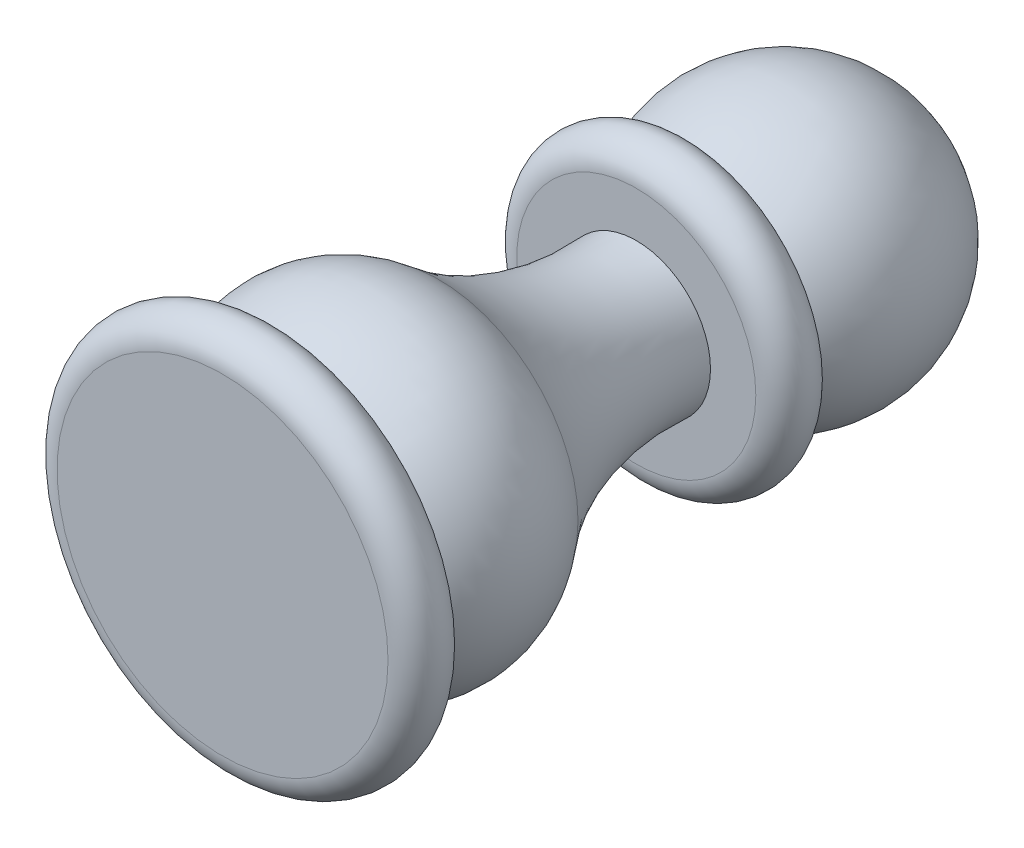
ISO-10303-21;
HEADER;
FILE_DESCRIPTION(('STEP AP214'),'2;1');
FILE_NAME('part.step','',(''),(''),'','','');
FILE_SCHEMA(('AUTOMOTIVE_DESIGN { 1 0 10303 214 1 1 1 1 }'));
ENDSEC;
DATA;
#1=APPLICATION_CONTEXT('core data for automotive mechanical design processes');
#2=APPLICATION_PROTOCOL_DEFINITION('international standard','automotive_design',2000,#1);
#3=PRODUCT_CONTEXT('',#1,'mechanical');
#4=PRODUCT('Part','Part','',(#3));
#5=PRODUCT_RELATED_PRODUCT_CATEGORY('part','',(#4));
#6=PRODUCT_DEFINITION_FORMATION('','',#4);
#7=PRODUCT_DEFINITION_CONTEXT('part definition',#1,'design');
#8=PRODUCT_DEFINITION('design','',#6,#7);
#9=PRODUCT_DEFINITION_SHAPE('','',#8);
#10=(LENGTH_UNIT() NAMED_UNIT(*) SI_UNIT(.MILLI.,.METRE.));
#11=(NAMED_UNIT(*) PLANE_ANGLE_UNIT() SI_UNIT($,.RADIAN.));
#12=(NAMED_UNIT(*) SI_UNIT($,.STERADIAN.) SOLID_ANGLE_UNIT());
#13=UNCERTAINTY_MEASURE_WITH_UNIT(LENGTH_MEASURE(1.E-05),#10,'distance_accuracy_value','');
#14=(GEOMETRIC_REPRESENTATION_CONTEXT(3) GLOBAL_UNCERTAINTY_ASSIGNED_CONTEXT((#13)) GLOBAL_UNIT_ASSIGNED_CONTEXT((#10,
#11,#12)) REPRESENTATION_CONTEXT('',''));
#15=CARTESIAN_POINT('',(0.,0.,0.));
#16=DIRECTION('',(0.,0.,1.));
#17=DIRECTION('',(1.,0.,0.));
#18=AXIS2_PLACEMENT_3D('',#15,#16,#17);
#19=CARTESIAN_POINT('',(0.,0.,0.));
#20=DIRECTION('',(0.,0.,1.));
#21=DIRECTION('',(1.,0.,0.));
#22=AXIS2_PLACEMENT_3D('',#19,#20,#21);
#23=PLANE('',#22);
#24=CARTESIAN_POINT('',(0.,0.,0.));
#25=DIRECTION('',(0.,0.,1.));
#26=DIRECTION('',(1.,0.,0.));
#27=AXIS2_PLACEMENT_3D('',#24,#25,#26);
#28=CIRCLE('',#27,9.);
#29=CARTESIAN_POINT('',(9.,0.,0.));
#30=VERTEX_POINT('',#29);
#31=EDGE_CURVE('E10',#30,#30,#28,.T.);
#32=ORIENTED_EDGE('',*,*,#31,.T.);
#33=EDGE_LOOP('',(#32));
#34=FACE_BOUND('',#33,.T.);
#35=ADVANCED_FACE('F41',(#34),#23,.T.);
#36=CARTESIAN_POINT('',(0.,0.,-1.5));
#37=DIRECTION('',(0.,0.,1.));
#38=DIRECTION('',(1.,0.,0.));
#39=AXIS2_PLACEMENT_3D('',#36,#37,#38);
#40=TOROIDAL_SURFACE('',#39,9.,1.5);
#41=CARTESIAN_POINT('',(0.,0.,-3.));
#42=DIRECTION('',(0.,0.,1.));
#43=DIRECTION('',(1.,0.,0.));
#44=AXIS2_PLACEMENT_3D('',#41,#42,#43);
#45=CIRCLE('',#44,9.);
#46=CARTESIAN_POINT('',(9.,0.,-3.));
#47=VERTEX_POINT('',#46);
#48=EDGE_CURVE('E47',#47,#47,#45,.T.);
#49=ORIENTED_EDGE('',*,*,#48,.T.);
#50=EDGE_LOOP('',(#49));
#51=FACE_BOUND('',#50,.T.);
#52=ORIENTED_EDGE('',*,*,#31,.F.);
#53=EDGE_LOOP('',(#52));
#54=FACE_BOUND('',#53,.T.);
#55=ADVANCED_FACE('F85',(#51,#54),#40,.T.);
#56=CARTESIAN_POINT('',(0.,0.,-3.));
#57=DIRECTION('',(0.,0.,-1.));
#58=DIRECTION('',(-1.,0.,0.));
#59=AXIS2_PLACEMENT_3D('',#56,#57,#58);
#60=PLANE('',#59);
#61=CARTESIAN_POINT('',(0.,0.,-3.));
#62=DIRECTION('',(0.,0.,1.));
#63=DIRECTION('',(1.,0.,0.));
#64=AXIS2_PLACEMENT_3D('',#61,#62,#63);
#65=CIRCLE('',#64,6.5);
#66=CARTESIAN_POINT('',(6.5,0.,-3.));
#67=VERTEX_POINT('',#66);
#68=EDGE_CURVE('E51',#67,#67,#65,.T.);
#69=ORIENTED_EDGE('',*,*,#68,.T.);
#70=EDGE_LOOP('',(#69));
#71=FACE_BOUND('',#70,.T.);
#72=ORIENTED_EDGE('',*,*,#48,.F.);
#73=EDGE_LOOP('',(#72));
#74=FACE_BOUND('',#73,.T.);
#75=ADVANCED_FACE('F89',(#71,#74),#60,.T.);
#76=CARTESIAN_POINT('',(0.,0.,-7.87339717240448));
#77=DIRECTION('',(0.,0.,1.));
#78=DIRECTION('',(1.,0.,0.));
#79=AXIS2_PLACEMENT_3D('',#76,#77,#78);
#80=DEGENERATE_TOROIDAL_SURFACE('',#79,3.,6.,.T.);
#81=CARTESIAN_POINT('',(0.,0.,-11.7595316034718));
#82=DIRECTION('',(0.,0.,1.));
#83=DIRECTION('',(1.,0.,0.));
#84=AXIS2_PLACEMENT_3D('',#81,#82,#83);
#85=CIRCLE('',#84,7.57142857142857);
#86=CARTESIAN_POINT('',(7.57142857142857,0.,-11.7595316034718));
#87=VERTEX_POINT('',#86);
#88=EDGE_CURVE('E55',#87,#87,#85,.T.);
#89=ORIENTED_EDGE('',*,*,#88,.T.);
#90=EDGE_LOOP('',(#89));
#91=FACE_BOUND('',#90,.T.);
#92=ORIENTED_EDGE('',*,*,#68,.F.);
#93=EDGE_LOOP('',(#92));
#94=FACE_BOUND('',#93,.T.);
#95=ADVANCED_FACE('F93',(#91,#94),#80,.T.);
#96=CARTESIAN_POINT('',(0.,0.,-21.4748676811399));
#97=DIRECTION('',(0.,0.,1.));
#98=DIRECTION('',(1.,0.,0.));
#99=AXIS2_PLACEMENT_3D('',#96,#97,#98);
#100=TOROIDAL_SURFACE('',#99,19.,15.);
#101=CARTESIAN_POINT('',(0.,0.,-22.5));
#102=DIRECTION('',(0.,0.,1.));
#103=DIRECTION('',(1.,0.,0.));
#104=AXIS2_PLACEMENT_3D('',#101,#102,#103);
#105=CIRCLE('',#104,4.03507087458051);
#106=CARTESIAN_POINT('',(4.03507087458051,0.,-22.5));
#107=VERTEX_POINT('',#106);
#108=EDGE_CURVE('E60',#107,#107,#105,.T.);
#109=ORIENTED_EDGE('',*,*,#108,.T.);
#110=EDGE_LOOP('',(#109));
#111=FACE_BOUND('',#110,.T.);
#112=ORIENTED_EDGE('',*,*,#88,.F.);
#113=EDGE_LOOP('',(#112));
#114=FACE_BOUND('',#113,.T.);
#115=ADVANCED_FACE('F100',(#111,#114),#100,.F.);
#116=CARTESIAN_POINT('',(0.,0.,-22.5));
#117=DIRECTION('',(0.,0.,1.));
#118=DIRECTION('',(1.,0.,0.));
#119=AXIS2_PLACEMENT_3D('',#116,#117,#118);
#120=PLANE('',#119);
#121=CARTESIAN_POINT('',(0.,0.,-22.5));
#122=DIRECTION('',(0.,0.,1.));
#123=DIRECTION('',(1.,0.,0.));
#124=AXIS2_PLACEMENT_3D('',#121,#122,#123);
#125=CIRCLE('',#124,6.5);
#126=CARTESIAN_POINT('',(6.5,0.,-22.5));
#127=VERTEX_POINT('',#126);
#128=EDGE_CURVE('E63',#127,#127,#125,.T.);
#129=ORIENTED_EDGE('',*,*,#128,.T.);
#130=EDGE_LOOP('',(#129));
#131=FACE_BOUND('',#130,.T.);
#132=ORIENTED_EDGE('',*,*,#108,.F.);
#133=EDGE_LOOP('',(#132));
#134=FACE_BOUND('',#133,.T.);
#135=ADVANCED_FACE('F104',(#131,#134),#120,.T.);
#136=CARTESIAN_POINT('',(0.,0.,-24.));
#137=DIRECTION('',(0.,0.,1.));
#138=DIRECTION('',(1.,0.,0.));
#139=AXIS2_PLACEMENT_3D('',#136,#137,#138);
#140=TOROIDAL_SURFACE('',#139,6.5,1.5);
#141=CARTESIAN_POINT('',(0.,0.,-25.5));
#142=DIRECTION('',(0.,0.,1.));
#143=DIRECTION('',(1.,0.,0.));
#144=AXIS2_PLACEMENT_3D('',#141,#142,#143);
#145=CIRCLE('',#144,6.5);
#146=CARTESIAN_POINT('',(6.5,0.,-25.5));
#147=VERTEX_POINT('',#146);
#148=EDGE_CURVE('E66',#147,#147,#145,.T.);
#149=ORIENTED_EDGE('',*,*,#148,.T.);
#150=EDGE_LOOP('',(#149));
#151=FACE_BOUND('',#150,.T.);
#152=ORIENTED_EDGE('',*,*,#128,.F.);
#153=EDGE_LOOP('',(#152));
#154=FACE_BOUND('',#153,.T.);
#155=ADVANCED_FACE('F82',(#151,#154),#140,.T.);
#156=CARTESIAN_POINT('',(0.,0.,-25.5));
#157=DIRECTION('',(0.,0.,-1.));
#158=DIRECTION('',(-1.,0.,0.));
#159=AXIS2_PLACEMENT_3D('',#156,#157,#158);
#160=PLANE('',#159);
#161=CARTESIAN_POINT('',(0.,0.,-25.5));
#162=DIRECTION('',(0.,0.,1.));
#163=DIRECTION('',(1.,0.,0.));
#164=AXIS2_PLACEMENT_3D('',#161,#162,#163);
#165=CIRCLE('',#164,5.59016994374947);
#166=CARTESIAN_POINT('',(5.59016994374947,0.,-25.5));
#167=VERTEX_POINT('',#166);
#168=EDGE_CURVE('E69',#167,#167,#165,.T.);
#169=ORIENTED_EDGE('',*,*,#168,.T.);
#170=EDGE_LOOP('',(#169));
#171=FACE_BOUND('',#170,.T.);
#172=ORIENTED_EDGE('',*,*,#148,.F.);
#173=EDGE_LOOP('',(#172));
#174=FACE_BOUND('',#173,.T.);
#175=ADVANCED_FACE('F73',(#171,#174),#160,.T.);
#176=CARTESIAN_POINT('',(0.,0.,-30.5));
#177=DIRECTION('',(0.,0.,1.));
#178=DIRECTION('',(0.,-1.,0.));
#179=AXIS2_PLACEMENT_3D('',#176,#177,#178);
#180=SPHERICAL_SURFACE('',#179,7.5);
#181=ORIENTED_EDGE('',*,*,#168,.F.);
#182=EDGE_LOOP('',(#181));
#183=FACE_BOUND('',#182,.T.);
#184=ADVANCED_FACE('F76',(#183),#180,.T.);
#185=CLOSED_SHELL('',(#35,#55,#75,#95,#115,#135,#155,#175,#184));
#186=MANIFOLD_SOLID_BREP('B2',#185);
#187=ADVANCED_BREP_SHAPE_REPRESENTATION('',(#18,#186),#14);
#188=SHAPE_DEFINITION_REPRESENTATION(#9,#187);
ENDSEC;
END-ISO-10303-21;
